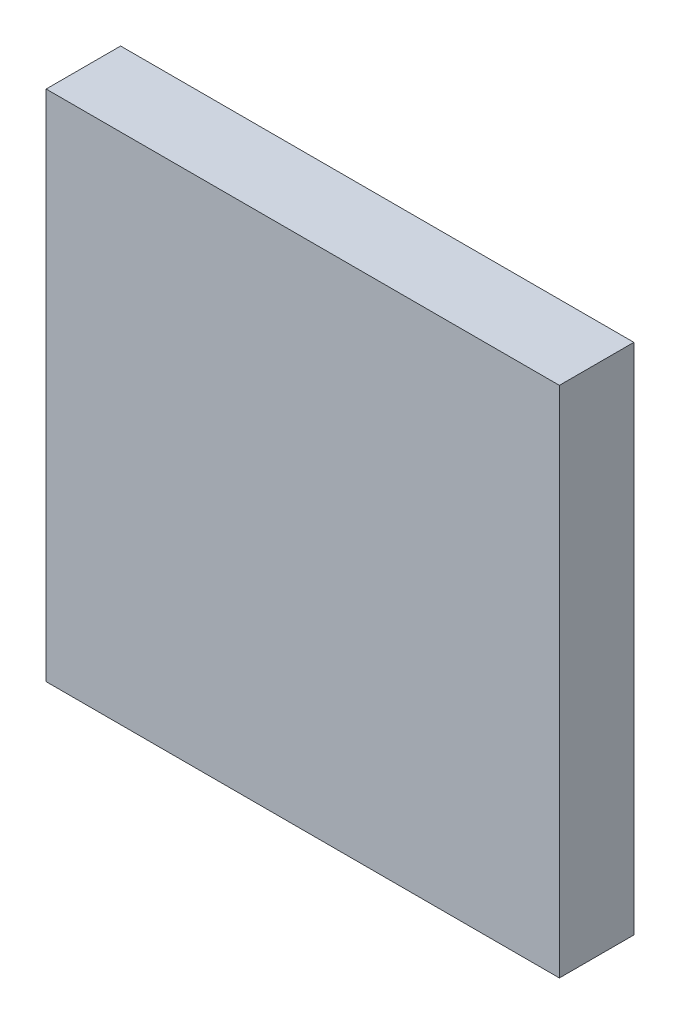
ISO-10303-21;
HEADER;
FILE_DESCRIPTION(('STEP AP214'),'2;1');
FILE_NAME('part.step','',(''),(''),'','','');
FILE_SCHEMA(('AUTOMOTIVE_DESIGN { 1 0 10303 214 1 1 1 1 }'));
ENDSEC;
DATA;
#1=APPLICATION_CONTEXT('core data for automotive mechanical design processes');
#2=APPLICATION_PROTOCOL_DEFINITION('international standard','automotive_design',2000,#1);
#3=PRODUCT_CONTEXT('',#1,'mechanical');
#4=PRODUCT('Part','Part','',(#3));
#5=PRODUCT_RELATED_PRODUCT_CATEGORY('part','',(#4));
#6=PRODUCT_DEFINITION_FORMATION('','',#4);
#7=PRODUCT_DEFINITION_CONTEXT('part definition',#1,'design');
#8=PRODUCT_DEFINITION('design','',#6,#7);
#9=PRODUCT_DEFINITION_SHAPE('','',#8);
#10=(LENGTH_UNIT() NAMED_UNIT(*) SI_UNIT(.MILLI.,.METRE.));
#11=(NAMED_UNIT(*) PLANE_ANGLE_UNIT() SI_UNIT($,.RADIAN.));
#12=(NAMED_UNIT(*) SI_UNIT($,.STERADIAN.) SOLID_ANGLE_UNIT());
#13=UNCERTAINTY_MEASURE_WITH_UNIT(LENGTH_MEASURE(1.E-05),#10,'distance_accuracy_value','');
#14=(GEOMETRIC_REPRESENTATION_CONTEXT(3) GLOBAL_UNCERTAINTY_ASSIGNED_CONTEXT((#13)) GLOBAL_UNIT_ASSIGNED_CONTEXT((#10,
#11,#12)) REPRESENTATION_CONTEXT('',''));
#15=CARTESIAN_POINT('',(0.,0.,0.));
#16=DIRECTION('',(0.,0.,1.));
#17=DIRECTION('',(1.,0.,0.));
#18=AXIS2_PLACEMENT_3D('',#15,#16,#17);
#19=CARTESIAN_POINT('',(0.87500206,-0.87499952,0.));
#20=DIRECTION('',(-1.,0.,0.));
#21=DIRECTION('',(0.,1.,0.));
#22=AXIS2_PLACEMENT_3D('',#19,#20,#21);
#23=PLANE('',#22);
#24=DIRECTION('',(0.,1.,0.));
#25=VECTOR('',#24,1.);
#26=CARTESIAN_POINT('',(0.87500206,-0.87499952,0.));
#27=LINE('',#26,#25);
#28=CARTESIAN_POINT('',(0.87500206,-0.87499952,0.));
#29=VERTEX_POINT('',#28);
#30=CARTESIAN_POINT('',(0.87500206,0.87500206,0.));
#31=VERTEX_POINT('',#30);
#32=EDGE_CURVE('E11',#29,#31,#27,.T.);
#33=ORIENTED_EDGE('',*,*,#32,.T.);
#34=DIRECTION('',(0.,0.,1.));
#35=VECTOR('',#34,1.);
#36=CARTESIAN_POINT('',(0.87500206,0.87500206,0.));
#37=LINE('',#36,#35);
#38=CARTESIAN_POINT('',(0.87500206,0.87500206,0.254));
#39=VERTEX_POINT('',#38);
#40=EDGE_CURVE('E24',#31,#39,#37,.T.);
#41=ORIENTED_EDGE('',*,*,#40,.T.);
#42=DIRECTION('',(0.,1.,0.));
#43=VECTOR('',#42,1.);
#44=CARTESIAN_POINT('',(0.87500206,-0.87499952,0.254));
#45=LINE('',#44,#43);
#46=CARTESIAN_POINT('',(0.87500206,-0.87499952,0.254));
#47=VERTEX_POINT('',#46);
#48=EDGE_CURVE('E87',#47,#39,#45,.T.);
#49=ORIENTED_EDGE('',*,*,#48,.F.);
#50=DIRECTION('',(0.,0.,1.));
#51=VECTOR('',#50,1.);
#52=CARTESIAN_POINT('',(0.87500206,-0.87499952,0.));
#53=LINE('',#52,#51);
#54=EDGE_CURVE('E36',#29,#47,#53,.T.);
#55=ORIENTED_EDGE('',*,*,#54,.F.);
#56=EDGE_LOOP('',(#33,#41,#49,#55));
#57=FACE_BOUND('',#56,.T.);
#58=ADVANCED_FACE('F17',(#57),#23,.F.);
#59=CARTESIAN_POINT('',(0.87500206,0.87500206,0.));
#60=DIRECTION('',(0.,-1.,0.));
#61=DIRECTION('',(-1.,0.,0.));
#62=AXIS2_PLACEMENT_3D('',#59,#60,#61);
#63=PLANE('',#62);
#64=DIRECTION('',(-1.,0.,0.));
#65=VECTOR('',#64,1.);
#66=CARTESIAN_POINT('',(0.87500206,0.87500206,0.));
#67=LINE('',#66,#65);
#68=CARTESIAN_POINT('',(-0.87499952,0.87500206,0.));
#69=VERTEX_POINT('',#68);
#70=EDGE_CURVE('E84',#31,#69,#67,.T.);
#71=ORIENTED_EDGE('',*,*,#70,.T.);
#72=DIRECTION('',(0.,0.,1.));
#73=VECTOR('',#72,1.);
#74=CARTESIAN_POINT('',(-0.87499952,0.87500206,0.));
#75=LINE('',#74,#73);
#76=CARTESIAN_POINT('',(-0.87499952,0.87500206,0.254));
#77=VERTEX_POINT('',#76);
#78=EDGE_CURVE('E82',#69,#77,#75,.T.);
#79=ORIENTED_EDGE('',*,*,#78,.T.);
#80=DIRECTION('',(-1.,0.,0.));
#81=VECTOR('',#80,1.);
#82=CARTESIAN_POINT('',(0.87500206,0.87500206,0.254));
#83=LINE('',#82,#81);
#84=EDGE_CURVE('E62',#39,#77,#83,.T.);
#85=ORIENTED_EDGE('',*,*,#84,.F.);
#86=ORIENTED_EDGE('',*,*,#40,.F.);
#87=EDGE_LOOP('',(#71,#79,#85,#86));
#88=FACE_BOUND('',#87,.T.);
#89=ADVANCED_FACE('F89',(#88),#63,.F.);
#90=CARTESIAN_POINT('',(-0.87499952,0.87500206,0.));
#91=DIRECTION('',(1.,0.,0.));
#92=DIRECTION('',(0.,-1.,0.));
#93=AXIS2_PLACEMENT_3D('',#90,#91,#92);
#94=PLANE('',#93);
#95=DIRECTION('',(0.,-1.,0.));
#96=VECTOR('',#95,1.);
#97=CARTESIAN_POINT('',(-0.87499952,0.87500206,0.));
#98=LINE('',#97,#96);
#99=CARTESIAN_POINT('',(-0.87499952,-0.87499952,0.));
#100=VERTEX_POINT('',#99);
#101=EDGE_CURVE('E71',#69,#100,#98,.T.);
#102=ORIENTED_EDGE('',*,*,#101,.T.);
#103=DIRECTION('',(0.,0.,1.));
#104=VECTOR('',#103,1.);
#105=CARTESIAN_POINT('',(-0.87499952,-0.87499952,0.));
#106=LINE('',#105,#104);
#107=CARTESIAN_POINT('',(-0.87499952,-0.87499952,0.254));
#108=VERTEX_POINT('',#107);
#109=EDGE_CURVE('E65',#100,#108,#106,.T.);
#110=ORIENTED_EDGE('',*,*,#109,.T.);
#111=DIRECTION('',(0.,-1.,0.));
#112=VECTOR('',#111,1.);
#113=CARTESIAN_POINT('',(-0.87499952,0.87500206,0.254));
#114=LINE('',#113,#112);
#115=EDGE_CURVE('E57',#77,#108,#114,.T.);
#116=ORIENTED_EDGE('',*,*,#115,.F.);
#117=ORIENTED_EDGE('',*,*,#78,.F.);
#118=EDGE_LOOP('',(#102,#110,#116,#117));
#119=FACE_BOUND('',#118,.T.);
#120=ADVANCED_FACE('F69',(#119),#94,.F.);
#121=CARTESIAN_POINT('',(-0.87499952,-0.87499952,0.));
#122=DIRECTION('',(0.,1.,0.));
#123=DIRECTION('',(1.,0.,0.));
#124=AXIS2_PLACEMENT_3D('',#121,#122,#123);
#125=PLANE('',#124);
#126=DIRECTION('',(1.,0.,0.));
#127=VECTOR('',#126,1.);
#128=CARTESIAN_POINT('',(-0.87499952,-0.87499952,0.));
#129=LINE('',#128,#127);
#130=EDGE_CURVE('E66',#100,#29,#129,.T.);
#131=ORIENTED_EDGE('',*,*,#130,.T.);
#132=ORIENTED_EDGE('',*,*,#54,.T.);
#133=DIRECTION('',(1.,0.,0.));
#134=VECTOR('',#133,1.);
#135=CARTESIAN_POINT('',(-0.87499952,-0.87499952,0.254));
#136=LINE('',#135,#134);
#137=EDGE_CURVE('E61',#108,#47,#136,.T.);
#138=ORIENTED_EDGE('',*,*,#137,.F.);
#139=ORIENTED_EDGE('',*,*,#109,.F.);
#140=EDGE_LOOP('',(#131,#132,#138,#139));
#141=FACE_BOUND('',#140,.T.);
#142=ADVANCED_FACE('F76',(#141),#125,.F.);
#143=CARTESIAN_POINT('',(0.87500206,-0.87499952,0.));
#144=DIRECTION('',(0.,0.,-1.));
#145=DIRECTION('',(-1.,0.,0.));
#146=AXIS2_PLACEMENT_3D('',#143,#144,#145);
#147=PLANE('',#146);
#148=ORIENTED_EDGE('',*,*,#130,.F.);
#149=ORIENTED_EDGE('',*,*,#101,.F.);
#150=ORIENTED_EDGE('',*,*,#70,.F.);
#151=ORIENTED_EDGE('',*,*,#32,.F.);
#152=EDGE_LOOP('',(#148,#149,#150,#151));
#153=FACE_BOUND('',#152,.T.);
#154=ADVANCED_FACE('F91',(#153),#147,.T.);
#155=CARTESIAN_POINT('',(0.87500206,-0.87499952,0.254));
#156=DIRECTION('',(0.,0.,-1.));
#157=DIRECTION('',(-1.,0.,0.));
#158=AXIS2_PLACEMENT_3D('',#155,#156,#157);
#159=PLANE('',#158);
#160=ORIENTED_EDGE('',*,*,#48,.T.);
#161=ORIENTED_EDGE('',*,*,#84,.T.);
#162=ORIENTED_EDGE('',*,*,#115,.T.);
#163=ORIENTED_EDGE('',*,*,#137,.T.);
#164=EDGE_LOOP('',(#160,#161,#162,#163));
#165=FACE_BOUND('',#164,.T.);
#166=ADVANCED_FACE('F59',(#165),#159,.F.);
#167=CLOSED_SHELL('',(#58,#89,#120,#142,#154,#166));
#168=MANIFOLD_SOLID_BREP('B1',#167);
#169=ADVANCED_BREP_SHAPE_REPRESENTATION('',(#18,#168),#14);
#170=SHAPE_DEFINITION_REPRESENTATION(#9,#169);
ENDSEC;
END-ISO-10303-21;
